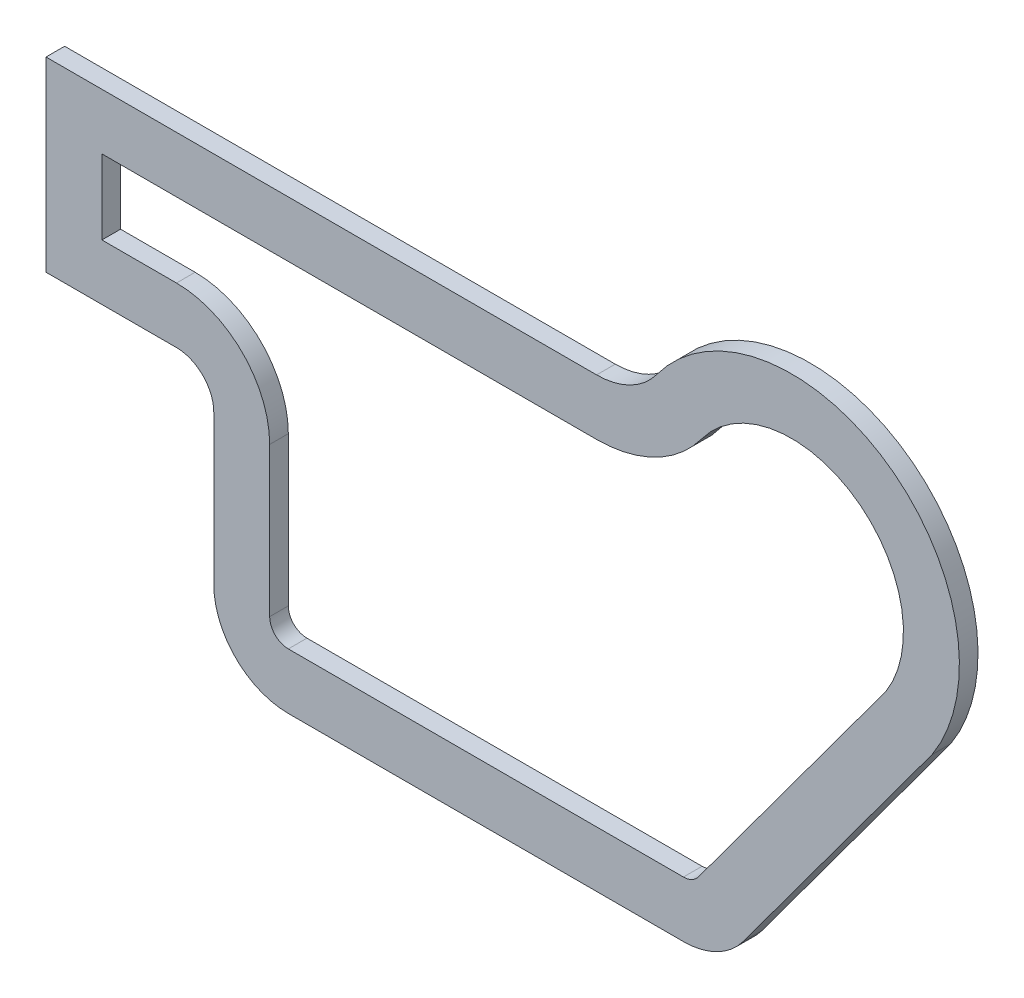
ISO-10303-21;
HEADER;
FILE_DESCRIPTION(('STEP AP214'),'2;1');
FILE_NAME('part.step','',(''),(''),'','','');
FILE_SCHEMA(('AUTOMOTIVE_DESIGN { 1 0 10303 214 1 1 1 1 }'));
ENDSEC;
DATA;
#1=APPLICATION_CONTEXT('core data for automotive mechanical design processes');
#2=APPLICATION_PROTOCOL_DEFINITION('international standard','automotive_design',2000,#1);
#3=PRODUCT_CONTEXT('',#1,'mechanical');
#4=PRODUCT('Part','Part','',(#3));
#5=PRODUCT_RELATED_PRODUCT_CATEGORY('part','',(#4));
#6=PRODUCT_DEFINITION_FORMATION('','',#4);
#7=PRODUCT_DEFINITION_CONTEXT('part definition',#1,'design');
#8=PRODUCT_DEFINITION('design','',#6,#7);
#9=PRODUCT_DEFINITION_SHAPE('','',#8);
#10=(LENGTH_UNIT() NAMED_UNIT(*) SI_UNIT(.MILLI.,.METRE.));
#11=(NAMED_UNIT(*) PLANE_ANGLE_UNIT() SI_UNIT($,.RADIAN.));
#12=(NAMED_UNIT(*) SI_UNIT($,.STERADIAN.) SOLID_ANGLE_UNIT());
#13=UNCERTAINTY_MEASURE_WITH_UNIT(LENGTH_MEASURE(1.E-05),#10,'distance_accuracy_value','');
#14=(GEOMETRIC_REPRESENTATION_CONTEXT(3) GLOBAL_UNCERTAINTY_ASSIGNED_CONTEXT((#13)) GLOBAL_UNIT_ASSIGNED_CONTEXT((#10,
#11,#12)) REPRESENTATION_CONTEXT('',''));
#15=CARTESIAN_POINT('',(0.,0.,0.));
#16=DIRECTION('',(0.,0.,1.));
#17=DIRECTION('',(1.,0.,0.));
#18=AXIS2_PLACEMENT_3D('',#15,#16,#17);
#19=CARTESIAN_POINT('',(35.,-10.,5.));
#20=DIRECTION('',(0.,0.,1.));
#21=DIRECTION('',(1.,0.,0.));
#22=AXIS2_PLACEMENT_3D('',#19,#20,#21);
#23=PLANE('',#22);
#24=DIRECTION('',(1.,0.,0.));
#25=VECTOR('',#24,1.);
#26=CARTESIAN_POINT('',(0.,0.,5.));
#27=LINE('',#26,#25);
#28=CARTESIAN_POINT('',(0.,0.,5.));
#29=VERTEX_POINT('',#28);
#30=CARTESIAN_POINT('',(35.,0.,5.));
#31=VERTEX_POINT('',#30);
#32=EDGE_CURVE('E267',#29,#31,#27,.T.);
#33=ORIENTED_EDGE('',*,*,#32,.T.);
#34=CARTESIAN_POINT('',(35.,-10.,5.));
#35=DIRECTION('',(0.,0.,-1.));
#36=DIRECTION('',(1.,0.,0.));
#37=AXIS2_PLACEMENT_3D('',#34,#35,#36);
#38=CIRCLE('',#37,10.);
#39=CARTESIAN_POINT('',(45.,-10.,5.));
#40=VERTEX_POINT('',#39);
#41=EDGE_CURVE('E270',#31,#40,#38,.T.);
#42=ORIENTED_EDGE('',*,*,#41,.T.);
#43=DIRECTION('',(0.,-1.,0.));
#44=VECTOR('',#43,1.);
#45=CARTESIAN_POINT('',(45.,-10.,5.));
#46=LINE('',#45,#44);
#47=CARTESIAN_POINT('',(45.,-50.,5.));
#48=VERTEX_POINT('',#47);
#49=EDGE_CURVE('E273',#40,#48,#46,.T.);
#50=ORIENTED_EDGE('',*,*,#49,.T.);
#51=CARTESIAN_POINT('',(65.,-50.,5.));
#52=DIRECTION('',(0.,0.,1.));
#53=DIRECTION('',(-1.,0.,0.));
#54=AXIS2_PLACEMENT_3D('',#51,#52,#53);
#55=CIRCLE('',#54,20.);
#56=CARTESIAN_POINT('',(65.,-70.,5.));
#57=VERTEX_POINT('',#56);
#58=EDGE_CURVE('E275',#48,#57,#55,.T.);
#59=ORIENTED_EDGE('',*,*,#58,.T.);
#60=DIRECTION('',(1.,0.,0.));
#61=VECTOR('',#60,1.);
#62=CARTESIAN_POINT('',(65.,-70.,5.));
#63=LINE('',#62,#61);
#64=CARTESIAN_POINT('',(170.979917239383,-70.,5.));
#65=VERTEX_POINT('',#64);
#66=EDGE_CURVE('E277',#57,#65,#63,.T.);
#67=ORIENTED_EDGE('',*,*,#66,.T.);
#68=CARTESIAN_POINT('',(170.979917239383,-50.,5.));
#69=DIRECTION('',(0.,0.,1.));
#70=DIRECTION('',(1.,0.,0.));
#71=AXIS2_PLACEMENT_3D('',#68,#69,#70);
#72=CIRCLE('',#71,20.);
#73=CARTESIAN_POINT('',(187.081159293785,-61.863810699162,5.));
#74=VERTEX_POINT('',#73);
#75=EDGE_CURVE('E279',#65,#74,#72,.T.);
#76=ORIENTED_EDGE('',*,*,#75,.T.);
#77=DIRECTION('',(0.593190534958103,0.805062102720107,0.));
#78=VECTOR('',#77,1.);
#79=CARTESIAN_POINT('',(187.081159293785,-61.863810699162,5.));
#80=LINE('',#79,#78);
#81=CARTESIAN_POINT('',(237.666102590851,6.7887021390434,5.));
#82=VERTEX_POINT('',#81);
#83=EDGE_CURVE('E281',#74,#82,#80,.T.);
#84=ORIENTED_EDGE('',*,*,#83,.T.);
#85=CARTESIAN_POINT('',(200.,31.4111454705955,5.));
#86=DIRECTION('',(0.,0.,1.));
#87=DIRECTION('',(1.,0.,0.));
#88=AXIS2_PLACEMENT_3D('',#85,#86,#87);
#89=CIRCLE('',#88,45.);
#90=CARTESIAN_POINT('',(163.788268533152,58.1265062986448,5.));
#91=VERTEX_POINT('',#90);
#92=EDGE_CURVE('E283',#82,#91,#89,.T.);
#93=ORIENTED_EDGE('',*,*,#92,.T.);
#94=CARTESIAN_POINT('',(147.694165658997,70.,5.));
#95=DIRECTION('',(0.,0.,-1.));
#96=DIRECTION('',(-1.,0.,0.));
#97=AXIS2_PLACEMENT_3D('',#94,#95,#96);
#98=CIRCLE('',#97,20.);
#99=CARTESIAN_POINT('',(147.694165658997,50.,5.));
#100=VERTEX_POINT('',#99);
#101=EDGE_CURVE('E285',#91,#100,#98,.T.);
#102=ORIENTED_EDGE('',*,*,#101,.T.);
#103=DIRECTION('',(-1.,0.,0.));
#104=VECTOR('',#103,1.);
#105=CARTESIAN_POINT('',(0.,50.,5.));
#106=LINE('',#105,#104);
#107=CARTESIAN_POINT('',(0.,50.,5.));
#108=VERTEX_POINT('',#107);
#109=EDGE_CURVE('E287',#100,#108,#106,.T.);
#110=ORIENTED_EDGE('',*,*,#109,.T.);
#111=DIRECTION('',(0.,-1.,0.));
#112=VECTOR('',#111,1.);
#113=CARTESIAN_POINT('',(0.,0.,5.));
#114=LINE('',#113,#112);
#115=EDGE_CURVE('E289',#108,#29,#114,.T.);
#116=ORIENTED_EDGE('',*,*,#115,.T.);
#117=EDGE_LOOP('',(#33,#42,#50,#59,#67,#76,#84,#93,#102,#110,#116));
#118=FACE_BOUND('',#117,.T.);
#119=DIRECTION('',(1.,0.,0.));
#120=VECTOR('',#119,1.);
#121=CARTESIAN_POINT('',(15.,15.,5.));
#122=LINE('',#121,#120);
#123=CARTESIAN_POINT('',(15.,15.,5.));
#124=VERTEX_POINT('',#123);
#125=CARTESIAN_POINT('',(35.,15.,5.));
#126=VERTEX_POINT('',#125);
#127=EDGE_CURVE('E189',#124,#126,#122,.T.);
#128=ORIENTED_EDGE('',*,*,#127,.F.);
#129=DIRECTION('',(0.,-1.,0.));
#130=VECTOR('',#129,1.);
#131=CARTESIAN_POINT('',(15.,15.,5.));
#132=LINE('',#131,#130);
#133=CARTESIAN_POINT('',(15.,35.,5.));
#134=VERTEX_POINT('',#133);
#135=EDGE_CURVE('E181',#134,#124,#132,.T.);
#136=ORIENTED_EDGE('',*,*,#135,.F.);
#137=DIRECTION('',(-1.,0.,0.));
#138=VECTOR('',#137,1.);
#139=CARTESIAN_POINT('',(15.,35.,5.));
#140=LINE('',#139,#138);
#141=CARTESIAN_POINT('',(147.694165658997,35.,5.));
#142=VERTEX_POINT('',#141);
#143=EDGE_CURVE('E220',#142,#134,#140,.T.);
#144=ORIENTED_EDGE('',*,*,#143,.F.);
#145=CARTESIAN_POINT('',(147.694165658997,70.,5.));
#146=DIRECTION('',(0.,0.,-1.));
#147=DIRECTION('',(-1.,0.,0.));
#148=AXIS2_PLACEMENT_3D('',#145,#146,#147);
#149=CIRCLE('',#148,35.);
#150=CARTESIAN_POINT('',(175.858845688768,49.2213860226284,5.));
#151=VERTEX_POINT('',#150);
#152=EDGE_CURVE('E218',#151,#142,#149,.T.);
#153=ORIENTED_EDGE('',*,*,#152,.F.);
#154=CARTESIAN_POINT('',(200.,31.4111454705955,5.));
#155=DIRECTION('',(0.,0.,1.));
#156=DIRECTION('',(1.,0.,0.));
#157=AXIS2_PLACEMENT_3D('',#154,#155,#156);
#158=CIRCLE('',#157,30.);
#159=CARTESIAN_POINT('',(225.315559898047,15.3138653572232,5.));
#160=VERTEX_POINT('',#159);
#161=EDGE_CURVE('E216',#160,#151,#158,.T.);
#162=ORIENTED_EDGE('',*,*,#161,.F.);
#163=DIRECTION('',(0.593190534958103,0.805062102720107,0.));
#164=VECTOR('',#163,1.);
#165=CARTESIAN_POINT('',(175.005227752984,-52.9659526747905,5.));
#166=LINE('',#165,#164);
#167=CARTESIAN_POINT('',(175.005227752984,-52.9659526747905,5.));
#168=VERTEX_POINT('',#167);
#169=EDGE_CURVE('E214',#168,#160,#166,.T.);
#170=ORIENTED_EDGE('',*,*,#169,.F.);
#171=CARTESIAN_POINT('',(170.979917239383,-50.,5.));
#172=DIRECTION('',(0.,0.,1.));
#173=DIRECTION('',(1.,0.,0.));
#174=AXIS2_PLACEMENT_3D('',#171,#172,#173);
#175=CIRCLE('',#174,4.99999999999998);
#176=CARTESIAN_POINT('',(170.979917239383,-55.,5.));
#177=VERTEX_POINT('',#176);
#178=EDGE_CURVE('E212',#177,#168,#175,.T.);
#179=ORIENTED_EDGE('',*,*,#178,.F.);
#180=DIRECTION('',(1.,0.,0.));
#181=VECTOR('',#180,1.);
#182=CARTESIAN_POINT('',(65.,-55.,5.));
#183=LINE('',#182,#181);
#184=CARTESIAN_POINT('',(65.,-55.,5.));
#185=VERTEX_POINT('',#184);
#186=EDGE_CURVE('E210',#185,#177,#183,.T.);
#187=ORIENTED_EDGE('',*,*,#186,.F.);
#188=CARTESIAN_POINT('',(65.,-50.,5.));
#189=DIRECTION('',(0.,0.,1.));
#190=DIRECTION('',(-1.,0.,0.));
#191=AXIS2_PLACEMENT_3D('',#188,#189,#190);
#192=CIRCLE('',#191,5.);
#193=CARTESIAN_POINT('',(60.,-50.,5.));
#194=VERTEX_POINT('',#193);
#195=EDGE_CURVE('E208',#194,#185,#192,.T.);
#196=ORIENTED_EDGE('',*,*,#195,.F.);
#197=DIRECTION('',(0.,-1.,0.));
#198=VECTOR('',#197,1.);
#199=CARTESIAN_POINT('',(60.,-10.,5.));
#200=LINE('',#199,#198);
#201=CARTESIAN_POINT('',(60.,-10.,5.));
#202=VERTEX_POINT('',#201);
#203=EDGE_CURVE('E204',#202,#194,#200,.T.);
#204=ORIENTED_EDGE('',*,*,#203,.F.);
#205=CARTESIAN_POINT('',(35.,-10.,5.));
#206=DIRECTION('',(0.,0.,-1.));
#207=DIRECTION('',(1.,0.,0.));
#208=AXIS2_PLACEMENT_3D('',#205,#206,#207);
#209=CIRCLE('',#208,25.);
#210=EDGE_CURVE('E202',#126,#202,#209,.T.);
#211=ORIENTED_EDGE('',*,*,#210,.F.);
#212=EDGE_LOOP('',(#128,#136,#144,#153,#162,#170,#179,#187,#196,#204,#211));
#213=FACE_BOUND('',#212,.T.);
#214=ADVANCED_FACE('F32',(#118,#213),#23,.T.);
#215=CARTESIAN_POINT('',(35.,-10.,0.));
#216=DIRECTION('',(0.,0.,1.));
#217=DIRECTION('',(1.,0.,0.));
#218=AXIS2_PLACEMENT_3D('',#215,#216,#217);
#219=PLANE('',#218);
#220=DIRECTION('',(1.,0.,0.));
#221=VECTOR('',#220,1.);
#222=CARTESIAN_POINT('',(0.,0.,0.));
#223=LINE('',#222,#221);
#224=CARTESIAN_POINT('',(0.,0.,0.));
#225=VERTEX_POINT('',#224);
#226=CARTESIAN_POINT('',(35.,0.,0.));
#227=VERTEX_POINT('',#226);
#228=EDGE_CURVE('E197',#225,#227,#223,.T.);
#229=ORIENTED_EDGE('',*,*,#228,.F.);
#230=DIRECTION('',(0.,-1.,0.));
#231=VECTOR('',#230,1.);
#232=CARTESIAN_POINT('',(0.,0.,0.));
#233=LINE('',#232,#231);
#234=CARTESIAN_POINT('',(0.,50.,0.));
#235=VERTEX_POINT('',#234);
#236=EDGE_CURVE('E271',#235,#225,#233,.T.);
#237=ORIENTED_EDGE('',*,*,#236,.F.);
#238=DIRECTION('',(-1.,0.,0.));
#239=VECTOR('',#238,1.);
#240=CARTESIAN_POINT('',(0.,50.,0.));
#241=LINE('',#240,#239);
#242=CARTESIAN_POINT('',(147.694165658997,50.,0.));
#243=VERTEX_POINT('',#242);
#244=EDGE_CURVE('E310',#243,#235,#241,.T.);
#245=ORIENTED_EDGE('',*,*,#244,.F.);
#246=CARTESIAN_POINT('',(147.694165658997,70.,0.));
#247=DIRECTION('',(0.,0.,-1.));
#248=DIRECTION('',(-1.,0.,0.));
#249=AXIS2_PLACEMENT_3D('',#246,#247,#248);
#250=CIRCLE('',#249,20.);
#251=CARTESIAN_POINT('',(163.788268533152,58.1265062986448,0.));
#252=VERTEX_POINT('',#251);
#253=EDGE_CURVE('E308',#252,#243,#250,.T.);
#254=ORIENTED_EDGE('',*,*,#253,.F.);
#255=CARTESIAN_POINT('',(200.,31.4111454705955,0.));
#256=DIRECTION('',(0.,0.,1.));
#257=DIRECTION('',(1.,0.,0.));
#258=AXIS2_PLACEMENT_3D('',#255,#256,#257);
#259=CIRCLE('',#258,45.);
#260=CARTESIAN_POINT('',(237.666102590851,6.7887021390434,0.));
#261=VERTEX_POINT('',#260);
#262=EDGE_CURVE('E306',#261,#252,#259,.T.);
#263=ORIENTED_EDGE('',*,*,#262,.F.);
#264=DIRECTION('',(0.593190534958103,0.805062102720107,0.));
#265=VECTOR('',#264,1.);
#266=CARTESIAN_POINT('',(187.081159293785,-61.863810699162,0.));
#267=LINE('',#266,#265);
#268=CARTESIAN_POINT('',(187.081159293785,-61.863810699162,0.));
#269=VERTEX_POINT('',#268);
#270=EDGE_CURVE('E304',#269,#261,#267,.T.);
#271=ORIENTED_EDGE('',*,*,#270,.F.);
#272=CARTESIAN_POINT('',(170.979917239383,-50.,0.));
#273=DIRECTION('',(0.,0.,1.));
#274=DIRECTION('',(1.,0.,0.));
#275=AXIS2_PLACEMENT_3D('',#272,#273,#274);
#276=CIRCLE('',#275,20.);
#277=CARTESIAN_POINT('',(170.979917239383,-70.,0.));
#278=VERTEX_POINT('',#277);
#279=EDGE_CURVE('E302',#278,#269,#276,.T.);
#280=ORIENTED_EDGE('',*,*,#279,.F.);
#281=DIRECTION('',(1.,0.,0.));
#282=VECTOR('',#281,1.);
#283=CARTESIAN_POINT('',(65.,-70.,0.));
#284=LINE('',#283,#282);
#285=CARTESIAN_POINT('',(65.,-70.,0.));
#286=VERTEX_POINT('',#285);
#287=EDGE_CURVE('E300',#286,#278,#284,.T.);
#288=ORIENTED_EDGE('',*,*,#287,.F.);
#289=CARTESIAN_POINT('',(65.,-50.,0.));
#290=DIRECTION('',(0.,0.,1.));
#291=DIRECTION('',(-1.,0.,0.));
#292=AXIS2_PLACEMENT_3D('',#289,#290,#291);
#293=CIRCLE('',#292,20.);
#294=CARTESIAN_POINT('',(45.,-50.,0.));
#295=VERTEX_POINT('',#294);
#296=EDGE_CURVE('E298',#295,#286,#293,.T.);
#297=ORIENTED_EDGE('',*,*,#296,.F.);
#298=DIRECTION('',(0.,-1.,0.));
#299=VECTOR('',#298,1.);
#300=CARTESIAN_POINT('',(45.,-10.,0.));
#301=LINE('',#300,#299);
#302=CARTESIAN_POINT('',(45.,-10.,0.));
#303=VERTEX_POINT('',#302);
#304=EDGE_CURVE('E296',#303,#295,#301,.T.);
#305=ORIENTED_EDGE('',*,*,#304,.F.);
#306=CARTESIAN_POINT('',(35.,-10.,0.));
#307=DIRECTION('',(0.,0.,-1.));
#308=DIRECTION('',(1.,0.,0.));
#309=AXIS2_PLACEMENT_3D('',#306,#307,#308);
#310=CIRCLE('',#309,10.);
#311=EDGE_CURVE('E294',#227,#303,#310,.T.);
#312=ORIENTED_EDGE('',*,*,#311,.F.);
#313=EDGE_LOOP('',(#229,#237,#245,#254,#263,#271,#280,#288,#297,#305,#312));
#314=FACE_BOUND('',#313,.T.);
#315=DIRECTION('',(0.,-1.,0.));
#316=VECTOR('',#315,1.);
#317=CARTESIAN_POINT('',(15.,15.,0.));
#318=LINE('',#317,#316);
#319=CARTESIAN_POINT('',(15.,35.,0.));
#320=VERTEX_POINT('',#319);
#321=CARTESIAN_POINT('',(15.,15.,0.));
#322=VERTEX_POINT('',#321);
#323=EDGE_CURVE('E55',#320,#322,#318,.T.);
#324=ORIENTED_EDGE('',*,*,#323,.T.);
#325=DIRECTION('',(1.,0.,0.));
#326=VECTOR('',#325,1.);
#327=CARTESIAN_POINT('',(15.,15.,0.));
#328=LINE('',#327,#326);
#329=CARTESIAN_POINT('',(35.,15.,0.));
#330=VERTEX_POINT('',#329);
#331=EDGE_CURVE('E196',#322,#330,#328,.T.);
#332=ORIENTED_EDGE('',*,*,#331,.T.);
#333=CARTESIAN_POINT('',(35.,-10.,0.));
#334=DIRECTION('',(0.,0.,-1.));
#335=DIRECTION('',(1.,0.,0.));
#336=AXIS2_PLACEMENT_3D('',#333,#334,#335);
#337=CIRCLE('',#336,25.);
#338=CARTESIAN_POINT('',(60.,-10.,0.));
#339=VERTEX_POINT('',#338);
#340=EDGE_CURVE('E224',#330,#339,#337,.T.);
#341=ORIENTED_EDGE('',*,*,#340,.T.);
#342=DIRECTION('',(0.,-1.,0.));
#343=VECTOR('',#342,1.);
#344=CARTESIAN_POINT('',(60.,-10.,0.));
#345=LINE('',#344,#343);
#346=CARTESIAN_POINT('',(60.,-50.,0.));
#347=VERTEX_POINT('',#346);
#348=EDGE_CURVE('E227',#339,#347,#345,.T.);
#349=ORIENTED_EDGE('',*,*,#348,.T.);
#350=CARTESIAN_POINT('',(65.,-50.,0.));
#351=DIRECTION('',(0.,0.,1.));
#352=DIRECTION('',(-1.,0.,0.));
#353=AXIS2_PLACEMENT_3D('',#350,#351,#352);
#354=CIRCLE('',#353,5.);
#355=CARTESIAN_POINT('',(65.,-55.,0.));
#356=VERTEX_POINT('',#355);
#357=EDGE_CURVE('E230',#347,#356,#354,.T.);
#358=ORIENTED_EDGE('',*,*,#357,.T.);
#359=DIRECTION('',(1.,0.,0.));
#360=VECTOR('',#359,1.);
#361=CARTESIAN_POINT('',(65.,-55.,0.));
#362=LINE('',#361,#360);
#363=CARTESIAN_POINT('',(170.979917239383,-55.,0.));
#364=VERTEX_POINT('',#363);
#365=EDGE_CURVE('E233',#356,#364,#362,.T.);
#366=ORIENTED_EDGE('',*,*,#365,.T.);
#367=CARTESIAN_POINT('',(170.979917239383,-50.,0.));
#368=DIRECTION('',(0.,0.,1.));
#369=DIRECTION('',(1.,0.,0.));
#370=AXIS2_PLACEMENT_3D('',#367,#368,#369);
#371=CIRCLE('',#370,4.99999999999998);
#372=CARTESIAN_POINT('',(175.005227752984,-52.9659526747905,0.));
#373=VERTEX_POINT('',#372);
#374=EDGE_CURVE('E236',#364,#373,#371,.T.);
#375=ORIENTED_EDGE('',*,*,#374,.T.);
#376=DIRECTION('',(0.593190534958103,0.805062102720107,0.));
#377=VECTOR('',#376,1.);
#378=CARTESIAN_POINT('',(175.005227752984,-52.9659526747905,0.));
#379=LINE('',#378,#377);
#380=CARTESIAN_POINT('',(225.315559898047,15.3138653572232,0.));
#381=VERTEX_POINT('',#380);
#382=EDGE_CURVE('E239',#373,#381,#379,.T.);
#383=ORIENTED_EDGE('',*,*,#382,.T.);
#384=CARTESIAN_POINT('',(200.,31.4111454705955,0.));
#385=DIRECTION('',(0.,0.,1.));
#386=DIRECTION('',(1.,0.,0.));
#387=AXIS2_PLACEMENT_3D('',#384,#385,#386);
#388=CIRCLE('',#387,30.);
#389=CARTESIAN_POINT('',(175.858845688768,49.2213860226284,0.));
#390=VERTEX_POINT('',#389);
#391=EDGE_CURVE('E242',#381,#390,#388,.T.);
#392=ORIENTED_EDGE('',*,*,#391,.T.);
#393=CARTESIAN_POINT('',(147.694165658997,70.,0.));
#394=DIRECTION('',(0.,0.,-1.));
#395=DIRECTION('',(-1.,0.,0.));
#396=AXIS2_PLACEMENT_3D('',#393,#394,#395);
#397=CIRCLE('',#396,35.);
#398=CARTESIAN_POINT('',(147.694165658997,35.,0.));
#399=VERTEX_POINT('',#398);
#400=EDGE_CURVE('E245',#390,#399,#397,.T.);
#401=ORIENTED_EDGE('',*,*,#400,.T.);
#402=DIRECTION('',(-1.,0.,0.));
#403=VECTOR('',#402,1.);
#404=CARTESIAN_POINT('',(15.,35.,0.));
#405=LINE('',#404,#403);
#406=EDGE_CURVE('E190',#399,#320,#405,.T.);
#407=ORIENTED_EDGE('',*,*,#406,.T.);
#408=EDGE_LOOP('',(#324,#332,#341,#349,#358,#366,#375,#383,#392,#401,#407));
#409=FACE_BOUND('',#408,.T.);
#410=ADVANCED_FACE('F349',(#314,#409),#219,.F.);
#411=CARTESIAN_POINT('',(0.,0.,5.));
#412=DIRECTION('',(0.,1.,0.));
#413=DIRECTION('',(0.,0.,1.));
#414=AXIS2_PLACEMENT_3D('',#411,#412,#413);
#415=PLANE('',#414);
#416=ORIENTED_EDGE('',*,*,#228,.T.);
#417=DIRECTION('',(0.,0.,-1.));
#418=VECTOR('',#417,1.);
#419=CARTESIAN_POINT('',(35.,0.,5.));
#420=LINE('',#419,#418);
#421=EDGE_CURVE('E11',#31,#227,#420,.T.);
#422=ORIENTED_EDGE('',*,*,#421,.F.);
#423=ORIENTED_EDGE('',*,*,#32,.F.);
#424=DIRECTION('',(0.,0.,-1.));
#425=VECTOR('',#424,1.);
#426=CARTESIAN_POINT('',(0.,0.,5.));
#427=LINE('',#426,#425);
#428=EDGE_CURVE('E291',#29,#225,#427,.T.);
#429=ORIENTED_EDGE('',*,*,#428,.T.);
#430=EDGE_LOOP('',(#416,#422,#423,#429));
#431=FACE_BOUND('',#430,.T.);
#432=ADVANCED_FACE('F34',(#431),#415,.F.);
#433=CARTESIAN_POINT('',(35.,-10.,5.));
#434=DIRECTION('',(0.,0.,-1.));
#435=DIRECTION('',(-1.,0.,0.));
#436=AXIS2_PLACEMENT_3D('',#433,#434,#435);
#437=CYLINDRICAL_SURFACE('',#436,10.);
#438=ORIENTED_EDGE('',*,*,#311,.T.);
#439=DIRECTION('',(0.,0.,-1.));
#440=VECTOR('',#439,1.);
#441=CARTESIAN_POINT('',(45.,-10.,5.));
#442=LINE('',#441,#440);
#443=EDGE_CURVE('E40',#40,#303,#442,.T.);
#444=ORIENTED_EDGE('',*,*,#443,.F.);
#445=ORIENTED_EDGE('',*,*,#41,.F.);
#446=ORIENTED_EDGE('',*,*,#421,.T.);
#447=EDGE_LOOP('',(#438,#444,#445,#446));
#448=FACE_BOUND('',#447,.T.);
#449=ADVANCED_FACE('F366',(#448),#437,.F.);
#450=CARTESIAN_POINT('',(45.,-10.,5.));
#451=DIRECTION('',(1.,0.,0.));
#452=DIRECTION('',(0.,0.,-1.));
#453=AXIS2_PLACEMENT_3D('',#450,#451,#452);
#454=PLANE('',#453);
#455=ORIENTED_EDGE('',*,*,#304,.T.);
#456=DIRECTION('',(0.,0.,-1.));
#457=VECTOR('',#456,1.);
#458=CARTESIAN_POINT('',(45.,-50.,5.));
#459=LINE('',#458,#457);
#460=EDGE_CURVE('E336',#48,#295,#459,.T.);
#461=ORIENTED_EDGE('',*,*,#460,.F.);
#462=ORIENTED_EDGE('',*,*,#49,.F.);
#463=ORIENTED_EDGE('',*,*,#443,.T.);
#464=EDGE_LOOP('',(#455,#461,#462,#463));
#465=FACE_BOUND('',#464,.T.);
#466=ADVANCED_FACE('F343',(#465),#454,.F.);
#467=CARTESIAN_POINT('',(65.,-50.,5.));
#468=DIRECTION('',(0.,0.,-1.));
#469=DIRECTION('',(-1.,0.,0.));
#470=AXIS2_PLACEMENT_3D('',#467,#468,#469);
#471=CYLINDRICAL_SURFACE('',#470,20.);
#472=ORIENTED_EDGE('',*,*,#296,.T.);
#473=DIRECTION('',(0.,0.,-1.));
#474=VECTOR('',#473,1.);
#475=CARTESIAN_POINT('',(65.,-70.,5.));
#476=LINE('',#475,#474);
#477=EDGE_CURVE('E333',#57,#286,#476,.T.);
#478=ORIENTED_EDGE('',*,*,#477,.F.);
#479=ORIENTED_EDGE('',*,*,#58,.F.);
#480=ORIENTED_EDGE('',*,*,#460,.T.);
#481=EDGE_LOOP('',(#472,#478,#479,#480));
#482=FACE_BOUND('',#481,.T.);
#483=ADVANCED_FACE('F355',(#482),#471,.T.);
#484=CARTESIAN_POINT('',(65.,-70.,5.));
#485=DIRECTION('',(0.,1.,0.));
#486=DIRECTION('',(-1.,0.,0.));
#487=AXIS2_PLACEMENT_3D('',#484,#485,#486);
#488=PLANE('',#487);
#489=ORIENTED_EDGE('',*,*,#287,.T.);
#490=DIRECTION('',(0.,0.,-1.));
#491=VECTOR('',#490,1.);
#492=CARTESIAN_POINT('',(170.979917239383,-70.,5.));
#493=LINE('',#492,#491);
#494=EDGE_CURVE('E330',#65,#278,#493,.T.);
#495=ORIENTED_EDGE('',*,*,#494,.F.);
#496=ORIENTED_EDGE('',*,*,#66,.F.);
#497=ORIENTED_EDGE('',*,*,#477,.T.);
#498=EDGE_LOOP('',(#489,#495,#496,#497));
#499=FACE_BOUND('',#498,.T.);
#500=ADVANCED_FACE('F359',(#499),#488,.F.);
#501=CARTESIAN_POINT('',(170.979917239383,-50.,5.));
#502=DIRECTION('',(0.,0.,-1.));
#503=DIRECTION('',(-1.,0.,0.));
#504=AXIS2_PLACEMENT_3D('',#501,#502,#503);
#505=CYLINDRICAL_SURFACE('',#504,20.);
#506=ORIENTED_EDGE('',*,*,#279,.T.);
#507=DIRECTION('',(0.,0.,-1.));
#508=VECTOR('',#507,1.);
#509=CARTESIAN_POINT('',(187.081159293785,-61.863810699162,5.));
#510=LINE('',#509,#508);
#511=EDGE_CURVE('E327',#74,#269,#510,.T.);
#512=ORIENTED_EDGE('',*,*,#511,.F.);
#513=ORIENTED_EDGE('',*,*,#75,.F.);
#514=ORIENTED_EDGE('',*,*,#494,.T.);
#515=EDGE_LOOP('',(#506,#512,#513,#514));
#516=FACE_BOUND('',#515,.T.);
#517=ADVANCED_FACE('F394',(#516),#505,.T.);
#518=CARTESIAN_POINT('',(187.081159293785,-61.863810699162,5.));
#519=DIRECTION('',(-0.805062102720107,0.593190534958103,0.));
#520=DIRECTION('',(-0.593190534958103,-0.805062102720107,0.));
#521=AXIS2_PLACEMENT_3D('',#518,#519,#520);
#522=PLANE('',#521);
#523=ORIENTED_EDGE('',*,*,#270,.T.);
#524=DIRECTION('',(0.,0.,-1.));
#525=VECTOR('',#524,1.);
#526=CARTESIAN_POINT('',(237.666102590851,6.7887021390434,5.));
#527=LINE('',#526,#525);
#528=EDGE_CURVE('E324',#82,#261,#527,.T.);
#529=ORIENTED_EDGE('',*,*,#528,.F.);
#530=ORIENTED_EDGE('',*,*,#83,.F.);
#531=ORIENTED_EDGE('',*,*,#511,.T.);
#532=EDGE_LOOP('',(#523,#529,#530,#531));
#533=FACE_BOUND('',#532,.T.);
#534=ADVANCED_FACE('F392',(#533),#522,.F.);
#535=CARTESIAN_POINT('',(200.,31.4111454705955,5.));
#536=DIRECTION('',(0.,0.,-1.));
#537=DIRECTION('',(-1.,0.,0.));
#538=AXIS2_PLACEMENT_3D('',#535,#536,#537);
#539=CYLINDRICAL_SURFACE('',#538,45.);
#540=ORIENTED_EDGE('',*,*,#262,.T.);
#541=DIRECTION('',(0.,0.,-1.));
#542=VECTOR('',#541,1.);
#543=CARTESIAN_POINT('',(163.788268533152,58.1265062986448,5.));
#544=LINE('',#543,#542);
#545=EDGE_CURVE('E321',#91,#252,#544,.T.);
#546=ORIENTED_EDGE('',*,*,#545,.F.);
#547=ORIENTED_EDGE('',*,*,#92,.F.);
#548=ORIENTED_EDGE('',*,*,#528,.T.);
#549=EDGE_LOOP('',(#540,#546,#547,#548));
#550=FACE_BOUND('',#549,.T.);
#551=ADVANCED_FACE('F387',(#550),#539,.T.);
#552=CARTESIAN_POINT('',(147.694165658997,70.,5.));
#553=DIRECTION('',(0.,0.,-1.));
#554=DIRECTION('',(-1.,0.,0.));
#555=AXIS2_PLACEMENT_3D('',#552,#553,#554);
#556=CYLINDRICAL_SURFACE('',#555,20.);
#557=ORIENTED_EDGE('',*,*,#253,.T.);
#558=DIRECTION('',(0.,0.,-1.));
#559=VECTOR('',#558,1.);
#560=CARTESIAN_POINT('',(147.694165658997,50.,5.));
#561=LINE('',#560,#559);
#562=EDGE_CURVE('E318',#100,#243,#561,.T.);
#563=ORIENTED_EDGE('',*,*,#562,.F.);
#564=ORIENTED_EDGE('',*,*,#101,.F.);
#565=ORIENTED_EDGE('',*,*,#545,.T.);
#566=EDGE_LOOP('',(#557,#563,#564,#565));
#567=FACE_BOUND('',#566,.T.);
#568=ADVANCED_FACE('F382',(#567),#556,.F.);
#569=CARTESIAN_POINT('',(0.,50.,5.));
#570=DIRECTION('',(0.,-1.,0.));
#571=DIRECTION('',(0.,0.,-1.));
#572=AXIS2_PLACEMENT_3D('',#569,#570,#571);
#573=PLANE('',#572);
#574=ORIENTED_EDGE('',*,*,#244,.T.);
#575=DIRECTION('',(0.,0.,-1.));
#576=VECTOR('',#575,1.);
#577=CARTESIAN_POINT('',(0.,50.,5.));
#578=LINE('',#577,#576);
#579=EDGE_CURVE('E315',#108,#235,#578,.T.);
#580=ORIENTED_EDGE('',*,*,#579,.F.);
#581=ORIENTED_EDGE('',*,*,#109,.F.);
#582=ORIENTED_EDGE('',*,*,#562,.T.);
#583=EDGE_LOOP('',(#574,#580,#581,#582));
#584=FACE_BOUND('',#583,.T.);
#585=ADVANCED_FACE('F378',(#584),#573,.F.);
#586=CARTESIAN_POINT('',(0.,0.,5.));
#587=DIRECTION('',(1.,0.,0.));
#588=DIRECTION('',(0.,0.,-1.));
#589=AXIS2_PLACEMENT_3D('',#586,#587,#588);
#590=PLANE('',#589);
#591=ORIENTED_EDGE('',*,*,#236,.T.);
#592=ORIENTED_EDGE('',*,*,#428,.F.);
#593=ORIENTED_EDGE('',*,*,#115,.F.);
#594=ORIENTED_EDGE('',*,*,#579,.T.);
#595=EDGE_LOOP('',(#591,#592,#593,#594));
#596=FACE_BOUND('',#595,.T.);
#597=ADVANCED_FACE('F373',(#596),#590,.F.);
#598=CARTESIAN_POINT('',(15.,15.,5.));
#599=DIRECTION('',(1.,0.,0.));
#600=DIRECTION('',(0.,0.,-1.));
#601=AXIS2_PLACEMENT_3D('',#598,#599,#600);
#602=PLANE('',#601);
#603=ORIENTED_EDGE('',*,*,#323,.F.);
#604=DIRECTION('',(0.,0.,-1.));
#605=VECTOR('',#604,1.);
#606=CARTESIAN_POINT('',(15.,35.,5.));
#607=LINE('',#606,#605);
#608=EDGE_CURVE('E185',#134,#320,#607,.T.);
#609=ORIENTED_EDGE('',*,*,#608,.F.);
#610=ORIENTED_EDGE('',*,*,#135,.T.);
#611=DIRECTION('',(0.,0.,-1.));
#612=VECTOR('',#611,1.);
#613=CARTESIAN_POINT('',(15.,15.,5.));
#614=LINE('',#613,#612);
#615=EDGE_CURVE('E184',#124,#322,#614,.T.);
#616=ORIENTED_EDGE('',*,*,#615,.T.);
#617=EDGE_LOOP('',(#603,#609,#610,#616));
#618=FACE_BOUND('',#617,.T.);
#619=ADVANCED_FACE('F183',(#618),#602,.T.);
#620=CARTESIAN_POINT('',(15.,15.,5.));
#621=DIRECTION('',(0.,1.,0.));
#622=DIRECTION('',(-1.,0.,0.));
#623=AXIS2_PLACEMENT_3D('',#620,#621,#622);
#624=PLANE('',#623);
#625=ORIENTED_EDGE('',*,*,#331,.F.);
#626=ORIENTED_EDGE('',*,*,#615,.F.);
#627=ORIENTED_EDGE('',*,*,#127,.T.);
#628=DIRECTION('',(0.,0.,-1.));
#629=VECTOR('',#628,1.);
#630=CARTESIAN_POINT('',(35.,15.,5.));
#631=LINE('',#630,#629);
#632=EDGE_CURVE('E198',#126,#330,#631,.T.);
#633=ORIENTED_EDGE('',*,*,#632,.T.);
#634=EDGE_LOOP('',(#625,#626,#627,#633));
#635=FACE_BOUND('',#634,.T.);
#636=ADVANCED_FACE('F193',(#635),#624,.T.);
#637=CARTESIAN_POINT('',(35.,-10.,5.));
#638=DIRECTION('',(0.,0.,-1.));
#639=DIRECTION('',(-1.,0.,0.));
#640=AXIS2_PLACEMENT_3D('',#637,#638,#639);
#641=CYLINDRICAL_SURFACE('',#640,25.);
#642=ORIENTED_EDGE('',*,*,#340,.F.);
#643=ORIENTED_EDGE('',*,*,#632,.F.);
#644=ORIENTED_EDGE('',*,*,#210,.T.);
#645=DIRECTION('',(0.,0.,-1.));
#646=VECTOR('',#645,1.);
#647=CARTESIAN_POINT('',(60.,-10.,5.));
#648=LINE('',#647,#646);
#649=EDGE_CURVE('E264',#202,#339,#648,.T.);
#650=ORIENTED_EDGE('',*,*,#649,.T.);
#651=EDGE_LOOP('',(#642,#643,#644,#650));
#652=FACE_BOUND('',#651,.T.);
#653=ADVANCED_FACE('F446',(#652),#641,.T.);
#654=CARTESIAN_POINT('',(60.,-10.,5.));
#655=DIRECTION('',(1.,0.,0.));
#656=DIRECTION('',(0.,0.,-1.));
#657=AXIS2_PLACEMENT_3D('',#654,#655,#656);
#658=PLANE('',#657);
#659=ORIENTED_EDGE('',*,*,#348,.F.);
#660=ORIENTED_EDGE('',*,*,#649,.F.);
#661=ORIENTED_EDGE('',*,*,#203,.T.);
#662=DIRECTION('',(0.,0.,-1.));
#663=VECTOR('',#662,1.);
#664=CARTESIAN_POINT('',(60.,-50.,5.));
#665=LINE('',#664,#663);
#666=EDGE_CURVE('E262',#194,#347,#665,.T.);
#667=ORIENTED_EDGE('',*,*,#666,.T.);
#668=EDGE_LOOP('',(#659,#660,#661,#667));
#669=FACE_BOUND('',#668,.T.);
#670=ADVANCED_FACE('F452',(#669),#658,.T.);
#671=CARTESIAN_POINT('',(65.,-50.,5.));
#672=DIRECTION('',(0.,0.,-1.));
#673=DIRECTION('',(-1.,0.,0.));
#674=AXIS2_PLACEMENT_3D('',#671,#672,#673);
#675=CYLINDRICAL_SURFACE('',#674,5.);
#676=ORIENTED_EDGE('',*,*,#357,.F.);
#677=ORIENTED_EDGE('',*,*,#666,.F.);
#678=ORIENTED_EDGE('',*,*,#195,.T.);
#679=DIRECTION('',(0.,0.,-1.));
#680=VECTOR('',#679,1.);
#681=CARTESIAN_POINT('',(65.,-55.,5.));
#682=LINE('',#681,#680);
#683=EDGE_CURVE('E260',#185,#356,#682,.T.);
#684=ORIENTED_EDGE('',*,*,#683,.T.);
#685=EDGE_LOOP('',(#676,#677,#678,#684));
#686=FACE_BOUND('',#685,.T.);
#687=ADVANCED_FACE('F460',(#686),#675,.F.);
#688=CARTESIAN_POINT('',(65.,-55.,5.));
#689=DIRECTION('',(0.,1.,0.));
#690=DIRECTION('',(-1.,0.,0.));
#691=AXIS2_PLACEMENT_3D('',#688,#689,#690);
#692=PLANE('',#691);
#693=ORIENTED_EDGE('',*,*,#365,.F.);
#694=ORIENTED_EDGE('',*,*,#683,.F.);
#695=ORIENTED_EDGE('',*,*,#186,.T.);
#696=DIRECTION('',(0.,0.,-1.));
#697=VECTOR('',#696,1.);
#698=CARTESIAN_POINT('',(170.979917239383,-55.,5.));
#699=LINE('',#698,#697);
#700=EDGE_CURVE('E258',#177,#364,#699,.T.);
#701=ORIENTED_EDGE('',*,*,#700,.T.);
#702=EDGE_LOOP('',(#693,#694,#695,#701));
#703=FACE_BOUND('',#702,.T.);
#704=ADVANCED_FACE('F468',(#703),#692,.T.);
#705=CARTESIAN_POINT('',(170.979917239383,-50.,5.));
#706=DIRECTION('',(0.,0.,-1.));
#707=DIRECTION('',(-1.,0.,0.));
#708=AXIS2_PLACEMENT_3D('',#705,#706,#707);
#709=CYLINDRICAL_SURFACE('',#708,4.99999999999998);
#710=ORIENTED_EDGE('',*,*,#374,.F.);
#711=ORIENTED_EDGE('',*,*,#700,.F.);
#712=ORIENTED_EDGE('',*,*,#178,.T.);
#713=DIRECTION('',(0.,0.,-1.));
#714=VECTOR('',#713,1.);
#715=CARTESIAN_POINT('',(175.005227752984,-52.9659526747905,5.));
#716=LINE('',#715,#714);
#717=EDGE_CURVE('E256',#168,#373,#716,.T.);
#718=ORIENTED_EDGE('',*,*,#717,.T.);
#719=EDGE_LOOP('',(#710,#711,#712,#718));
#720=FACE_BOUND('',#719,.T.);
#721=ADVANCED_FACE('F476',(#720),#709,.F.);
#722=CARTESIAN_POINT('',(175.005227752984,-52.9659526747905,5.));
#723=DIRECTION('',(-0.805062102720107,0.593190534958103,0.));
#724=DIRECTION('',(-0.593190534958103,-0.805062102720107,0.));
#725=AXIS2_PLACEMENT_3D('',#722,#723,#724);
#726=PLANE('',#725);
#727=ORIENTED_EDGE('',*,*,#382,.F.);
#728=ORIENTED_EDGE('',*,*,#717,.F.);
#729=ORIENTED_EDGE('',*,*,#169,.T.);
#730=DIRECTION('',(0.,0.,-1.));
#731=VECTOR('',#730,1.);
#732=CARTESIAN_POINT('',(225.315559898047,15.3138653572232,5.));
#733=LINE('',#732,#731);
#734=EDGE_CURVE('E254',#160,#381,#733,.T.);
#735=ORIENTED_EDGE('',*,*,#734,.T.);
#736=EDGE_LOOP('',(#727,#728,#729,#735));
#737=FACE_BOUND('',#736,.T.);
#738=ADVANCED_FACE('F484',(#737),#726,.T.);
#739=CARTESIAN_POINT('',(200.,31.4111454705955,5.));
#740=DIRECTION('',(0.,0.,-1.));
#741=DIRECTION('',(-1.,0.,0.));
#742=AXIS2_PLACEMENT_3D('',#739,#740,#741);
#743=CYLINDRICAL_SURFACE('',#742,30.);
#744=ORIENTED_EDGE('',*,*,#391,.F.);
#745=ORIENTED_EDGE('',*,*,#734,.F.);
#746=ORIENTED_EDGE('',*,*,#161,.T.);
#747=DIRECTION('',(0.,0.,-1.));
#748=VECTOR('',#747,1.);
#749=CARTESIAN_POINT('',(175.858845688768,49.2213860226284,5.));
#750=LINE('',#749,#748);
#751=EDGE_CURVE('E252',#151,#390,#750,.T.);
#752=ORIENTED_EDGE('',*,*,#751,.T.);
#753=EDGE_LOOP('',(#744,#745,#746,#752));
#754=FACE_BOUND('',#753,.T.);
#755=ADVANCED_FACE('F492',(#754),#743,.F.);
#756=CARTESIAN_POINT('',(147.694165658997,70.,5.));
#757=DIRECTION('',(0.,0.,-1.));
#758=DIRECTION('',(-1.,0.,0.));
#759=AXIS2_PLACEMENT_3D('',#756,#757,#758);
#760=CYLINDRICAL_SURFACE('',#759,35.);
#761=ORIENTED_EDGE('',*,*,#400,.F.);
#762=ORIENTED_EDGE('',*,*,#751,.F.);
#763=ORIENTED_EDGE('',*,*,#152,.T.);
#764=DIRECTION('',(0.,0.,-1.));
#765=VECTOR('',#764,1.);
#766=CARTESIAN_POINT('',(147.694165658997,35.,5.));
#767=LINE('',#766,#765);
#768=EDGE_CURVE('E47',#142,#399,#767,.T.);
#769=ORIENTED_EDGE('',*,*,#768,.T.);
#770=EDGE_LOOP('',(#761,#762,#763,#769));
#771=FACE_BOUND('',#770,.T.);
#772=ADVANCED_FACE('F500',(#771),#760,.T.);
#773=CARTESIAN_POINT('',(15.,35.,5.));
#774=DIRECTION('',(0.,-1.,0.));
#775=DIRECTION('',(0.,0.,-1.));
#776=AXIS2_PLACEMENT_3D('',#773,#774,#775);
#777=PLANE('',#776);
#778=ORIENTED_EDGE('',*,*,#406,.F.);
#779=ORIENTED_EDGE('',*,*,#768,.F.);
#780=ORIENTED_EDGE('',*,*,#143,.T.);
#781=ORIENTED_EDGE('',*,*,#608,.T.);
#782=EDGE_LOOP('',(#778,#779,#780,#781));
#783=FACE_BOUND('',#782,.T.);
#784=ADVANCED_FACE('F508',(#783),#777,.T.);
#785=CLOSED_SHELL('',(#214,#410,#432,#449,#466,#483,#500,#517,#534,#551,#568,#585,#597,#619,
#636,#653,#670,#687,#704,#721,#738,#755,#772,#784));
#786=MANIFOLD_SOLID_BREP('B2',#785);
#787=ADVANCED_BREP_SHAPE_REPRESENTATION('',(#18,#786),#14);
#788=SHAPE_DEFINITION_REPRESENTATION(#9,#787);
ENDSEC;
END-ISO-10303-21;
